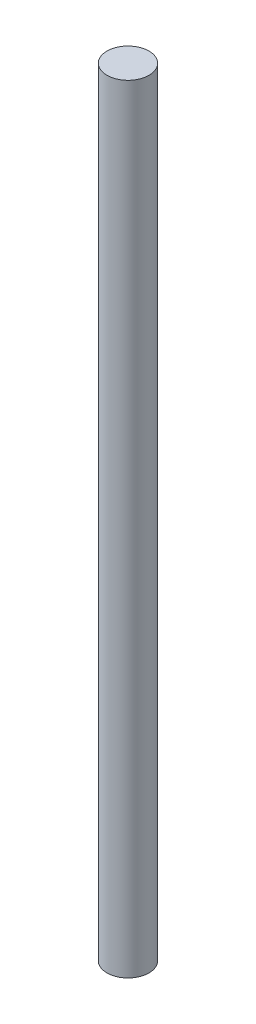
ISO-10303-21;
HEADER;
FILE_DESCRIPTION(('STEP AP214'),'2;1');
FILE_NAME('part.step','',(''),(''),'','','');
FILE_SCHEMA(('AUTOMOTIVE_DESIGN { 1 0 10303 214 1 1 1 1 }'));
ENDSEC;
DATA;
#1=APPLICATION_CONTEXT('core data for automotive mechanical design processes');
#2=APPLICATION_PROTOCOL_DEFINITION('international standard','automotive_design',2000,#1);
#3=PRODUCT_CONTEXT('',#1,'mechanical');
#4=PRODUCT('Part','Part','',(#3));
#5=PRODUCT_RELATED_PRODUCT_CATEGORY('part','',(#4));
#6=PRODUCT_DEFINITION_FORMATION('','',#4);
#7=PRODUCT_DEFINITION_CONTEXT('part definition',#1,'design');
#8=PRODUCT_DEFINITION('design','',#6,#7);
#9=PRODUCT_DEFINITION_SHAPE('','',#8);
#10=(LENGTH_UNIT() NAMED_UNIT(*) SI_UNIT(.MILLI.,.METRE.));
#11=(NAMED_UNIT(*) PLANE_ANGLE_UNIT() SI_UNIT($,.RADIAN.));
#12=(NAMED_UNIT(*) SI_UNIT($,.STERADIAN.) SOLID_ANGLE_UNIT());
#13=UNCERTAINTY_MEASURE_WITH_UNIT(LENGTH_MEASURE(1.E-05),#10,'distance_accuracy_value','');
#14=(GEOMETRIC_REPRESENTATION_CONTEXT(3) GLOBAL_UNCERTAINTY_ASSIGNED_CONTEXT((#13)) GLOBAL_UNIT_ASSIGNED_CONTEXT((#10,
#11,#12)) REPRESENTATION_CONTEXT('',''));
#15=CARTESIAN_POINT('',(0.,0.,0.));
#16=DIRECTION('',(0.,0.,1.));
#17=DIRECTION('',(1.,0.,0.));
#18=AXIS2_PLACEMENT_3D('',#15,#16,#17);
#19=CARTESIAN_POINT('',(0.,9.25,0.));
#20=DIRECTION('',(0.,-1.,0.));
#21=DIRECTION('',(0.,0.,-1.));
#22=AXIS2_PLACEMENT_3D('',#19,#20,#21);
#23=CYLINDRICAL_SURFACE('',#22,0.5);
#24=CARTESIAN_POINT('',(0.,9.25,0.));
#25=DIRECTION('',(0.,1.,0.));
#26=DIRECTION('',(0.,0.,1.));
#27=AXIS2_PLACEMENT_3D('',#24,#25,#26);
#28=CIRCLE('',#27,0.5);
#29=CARTESIAN_POINT('',(0.,9.25,0.5));
#30=VERTEX_POINT('',#29);
#31=EDGE_CURVE('E10',#30,#30,#28,.T.);
#32=ORIENTED_EDGE('',*,*,#31,.F.);
#33=EDGE_LOOP('',(#32));
#34=FACE_BOUND('',#33,.T.);
#35=CARTESIAN_POINT('',(0.,-9.25,0.));
#36=DIRECTION('',(0.,1.,0.));
#37=DIRECTION('',(0.,0.,1.));
#38=AXIS2_PLACEMENT_3D('',#35,#36,#37);
#39=CIRCLE('',#38,0.5);
#40=CARTESIAN_POINT('',(0.,-9.25,0.5));
#41=VERTEX_POINT('',#40);
#42=EDGE_CURVE('E34',#41,#41,#39,.T.);
#43=ORIENTED_EDGE('',*,*,#42,.T.);
#44=EDGE_LOOP('',(#43));
#45=FACE_BOUND('',#44,.T.);
#46=ADVANCED_FACE('F31',(#34,#45),#23,.T.);
#47=CARTESIAN_POINT('',(0.,9.25,0.));
#48=DIRECTION('',(0.,1.,0.));
#49=DIRECTION('',(0.,0.,1.));
#50=AXIS2_PLACEMENT_3D('',#47,#48,#49);
#51=PLANE('',#50);
#52=ORIENTED_EDGE('',*,*,#31,.T.);
#53=EDGE_LOOP('',(#52));
#54=FACE_BOUND('',#53,.T.);
#55=ADVANCED_FACE('F46',(#54),#51,.T.);
#56=CARTESIAN_POINT('',(0.,-9.25,0.));
#57=DIRECTION('',(0.,1.,0.));
#58=DIRECTION('',(0.,0.,1.));
#59=AXIS2_PLACEMENT_3D('',#56,#57,#58);
#60=PLANE('',#59);
#61=ORIENTED_EDGE('',*,*,#42,.F.);
#62=EDGE_LOOP('',(#61));
#63=FACE_BOUND('',#62,.T.);
#64=ADVANCED_FACE('F44',(#63),#60,.F.);
#65=CLOSED_SHELL('',(#46,#55,#64));
#66=MANIFOLD_SOLID_BREP('B2',#65);
#67=ADVANCED_BREP_SHAPE_REPRESENTATION('',(#18,#66),#14);
#68=SHAPE_DEFINITION_REPRESENTATION(#9,#67);
ENDSEC;
END-ISO-10303-21;
